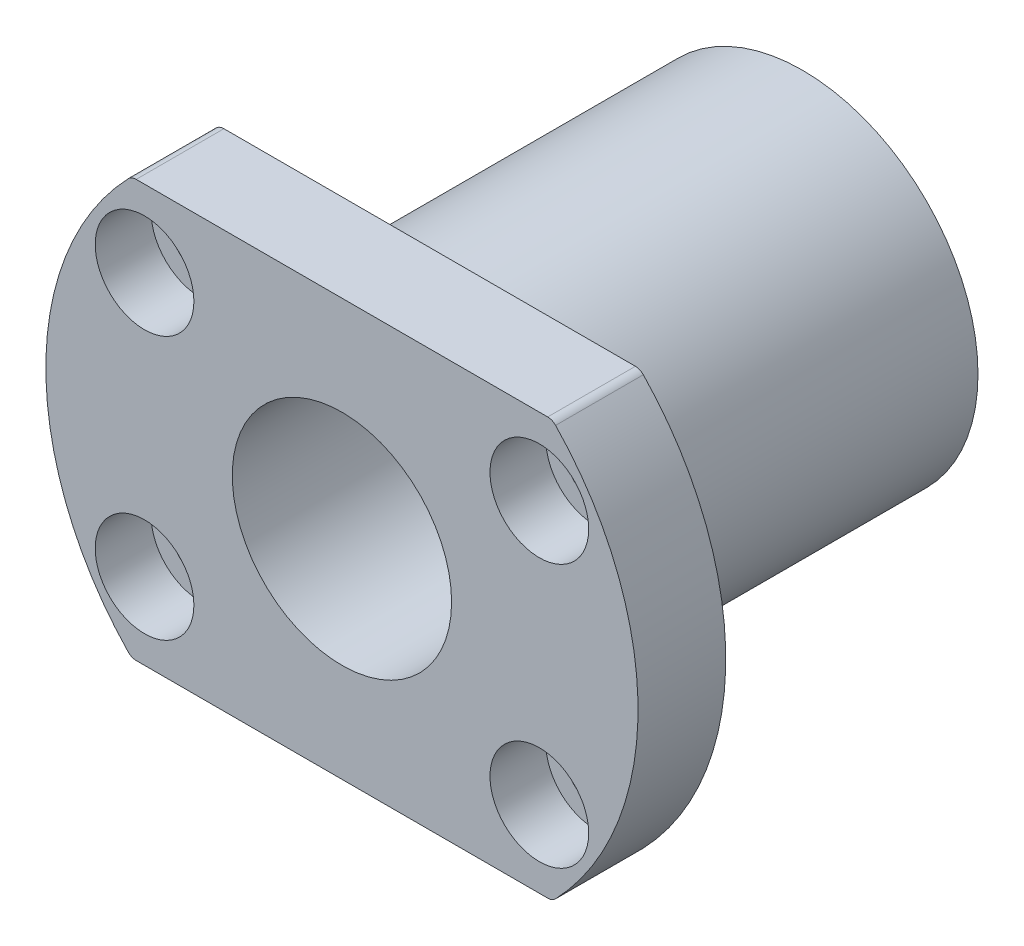
ISO-10303-21;
HEADER;
FILE_DESCRIPTION(('STEP AP214'),'2;1');
FILE_NAME('part.step','',(''),(''),'','','');
FILE_SCHEMA(('AUTOMOTIVE_DESIGN { 1 0 10303 214 1 1 1 1 }'));
ENDSEC;
DATA;
#1=APPLICATION_CONTEXT('core data for automotive mechanical design processes');
#2=APPLICATION_PROTOCOL_DEFINITION('international standard','automotive_design',2000,#1);
#3=PRODUCT_CONTEXT('',#1,'mechanical');
#4=PRODUCT('Part','Part','',(#3));
#5=PRODUCT_RELATED_PRODUCT_CATEGORY('part','',(#4));
#6=PRODUCT_DEFINITION_FORMATION('','',#4);
#7=PRODUCT_DEFINITION_CONTEXT('part definition',#1,'design');
#8=PRODUCT_DEFINITION('design','',#6,#7);
#9=PRODUCT_DEFINITION_SHAPE('','',#8);
#10=(LENGTH_UNIT() NAMED_UNIT(*) SI_UNIT(.MILLI.,.METRE.));
#11=(NAMED_UNIT(*) PLANE_ANGLE_UNIT() SI_UNIT($,.RADIAN.));
#12=(NAMED_UNIT(*) SI_UNIT($,.STERADIAN.) SOLID_ANGLE_UNIT());
#13=UNCERTAINTY_MEASURE_WITH_UNIT(LENGTH_MEASURE(1.E-05),#10,'distance_accuracy_value','');
#14=(GEOMETRIC_REPRESENTATION_CONTEXT(3) GLOBAL_UNCERTAINTY_ASSIGNED_CONTEXT((#13)) GLOBAL_UNIT_ASSIGNED_CONTEXT((#10,
#11,#12)) REPRESENTATION_CONTEXT('',''));
#15=CARTESIAN_POINT('',(0.,0.,0.));
#16=DIRECTION('',(0.,0.,1.));
#17=DIRECTION('',(1.,0.,0.));
#18=AXIS2_PLACEMENT_3D('',#15,#16,#17);
#19=CARTESIAN_POINT('',(0.,0.,0.));
#20=DIRECTION('',(0.,0.,1.));
#21=DIRECTION('',(1.,0.,0.));
#22=AXIS2_PLACEMENT_3D('',#19,#20,#21);
#23=PLANE('',#22);
#24=CARTESIAN_POINT('',(0.,0.,0.));
#25=DIRECTION('',(0.,0.,1.));
#26=DIRECTION('',(1.,0.,0.));
#27=AXIS2_PLACEMENT_3D('',#24,#25,#26);
#28=CIRCLE('',#27,16.);
#29=CARTESIAN_POINT('',(16.,0.,0.));
#30=VERTEX_POINT('',#29);
#31=EDGE_CURVE('E140',#30,#30,#28,.T.);
#32=ORIENTED_EDGE('',*,*,#31,.F.);
#33=EDGE_LOOP('',(#32));
#34=FACE_BOUND('',#33,.T.);
#35=CARTESIAN_POINT('',(0.,0.,0.));
#36=DIRECTION('',(0.,0.,1.));
#37=DIRECTION('',(1.,0.,0.));
#38=AXIS2_PLACEMENT_3D('',#35,#36,#37);
#39=CIRCLE('',#38,10.);
#40=CARTESIAN_POINT('',(10.,0.,0.));
#41=VERTEX_POINT('',#40);
#42=EDGE_CURVE('E137',#41,#41,#39,.T.);
#43=ORIENTED_EDGE('',*,*,#42,.T.);
#44=EDGE_LOOP('',(#43));
#45=FACE_BOUND('',#44,.T.);
#46=ADVANCED_FACE('F36',(#34,#45),#23,.F.);
#47=CARTESIAN_POINT('',(0.,0.,34.));
#48=DIRECTION('',(0.,0.,-1.));
#49=DIRECTION('',(-1.,0.,0.));
#50=AXIS2_PLACEMENT_3D('',#47,#48,#49);
#51=CYLINDRICAL_SURFACE('',#50,16.);
#52=CARTESIAN_POINT('',(0.,0.,34.));
#53=DIRECTION('',(0.,0.,1.));
#54=DIRECTION('',(1.,0.,0.));
#55=AXIS2_PLACEMENT_3D('',#52,#53,#54);
#56=CIRCLE('',#55,16.);
#57=CARTESIAN_POINT('',(16.,0.,34.));
#58=VERTEX_POINT('',#57);
#59=EDGE_CURVE('E141',#58,#58,#56,.T.);
#60=ORIENTED_EDGE('',*,*,#59,.F.);
#61=EDGE_LOOP('',(#60));
#62=FACE_BOUND('',#61,.T.);
#63=ORIENTED_EDGE('',*,*,#31,.T.);
#64=EDGE_LOOP('',(#63));
#65=FACE_BOUND('',#64,.T.);
#66=ADVANCED_FACE('F251',(#62,#65),#51,.T.);
#67=CARTESIAN_POINT('',(0.,0.,34.));
#68=DIRECTION('',(0.,0.,-1.));
#69=DIRECTION('',(-1.,0.,0.));
#70=AXIS2_PLACEMENT_3D('',#67,#68,#69);
#71=CYLINDRICAL_SURFACE('',#70,10.);
#72=ORIENTED_EDGE('',*,*,#42,.F.);
#73=EDGE_LOOP('',(#72));
#74=FACE_BOUND('',#73,.T.);
#75=CARTESIAN_POINT('',(0.,0.,42.));
#76=DIRECTION('',(0.,0.,1.));
#77=DIRECTION('',(1.,0.,0.));
#78=AXIS2_PLACEMENT_3D('',#75,#76,#77);
#79=CIRCLE('',#78,10.);
#80=CARTESIAN_POINT('',(10.,0.,42.));
#81=VERTEX_POINT('',#80);
#82=EDGE_CURVE('E149',#81,#81,#79,.T.);
#83=ORIENTED_EDGE('',*,*,#82,.T.);
#84=EDGE_LOOP('',(#83));
#85=FACE_BOUND('',#84,.T.);
#86=ADVANCED_FACE('F239',(#74,#85),#71,.F.);
#87=CARTESIAN_POINT('',(0.,0.,42.));
#88=DIRECTION('',(0.,0.,1.));
#89=DIRECTION('',(1.,0.,0.));
#90=AXIS2_PLACEMENT_3D('',#87,#88,#89);
#91=PLANE('',#90);
#92=CARTESIAN_POINT('',(-18.,-12.,42.));
#93=DIRECTION('',(0.,0.,1.));
#94=DIRECTION('',(1.,0.,0.));
#95=AXIS2_PLACEMENT_3D('',#92,#93,#94);
#96=CIRCLE('',#95,4.49999999999999);
#97=CARTESIAN_POINT('',(-13.5,-12.,42.));
#98=VERTEX_POINT('',#97);
#99=EDGE_CURVE('E230',#98,#98,#96,.T.);
#100=ORIENTED_EDGE('',*,*,#99,.F.);
#101=EDGE_LOOP('',(#100));
#102=FACE_BOUND('',#101,.T.);
#103=CARTESIAN_POINT('',(-18.,12.,42.));
#104=DIRECTION('',(0.,0.,1.));
#105=DIRECTION('',(1.,0.,0.));
#106=AXIS2_PLACEMENT_3D('',#103,#104,#105);
#107=CIRCLE('',#106,4.49999999999999);
#108=CARTESIAN_POINT('',(-13.5,12.,42.));
#109=VERTEX_POINT('',#108);
#110=EDGE_CURVE('E164',#109,#109,#107,.T.);
#111=ORIENTED_EDGE('',*,*,#110,.F.);
#112=EDGE_LOOP('',(#111));
#113=FACE_BOUND('',#112,.T.);
#114=CARTESIAN_POINT('',(18.,12.,42.));
#115=DIRECTION('',(0.,0.,1.));
#116=DIRECTION('',(1.,0.,0.));
#117=AXIS2_PLACEMENT_3D('',#114,#115,#116);
#118=CIRCLE('',#117,4.49999999999999);
#119=CARTESIAN_POINT('',(22.5,12.,42.));
#120=VERTEX_POINT('',#119);
#121=EDGE_CURVE('E159',#120,#120,#118,.T.);
#122=ORIENTED_EDGE('',*,*,#121,.F.);
#123=EDGE_LOOP('',(#122));
#124=FACE_BOUND('',#123,.T.);
#125=CARTESIAN_POINT('',(18.,-12.,42.));
#126=DIRECTION('',(0.,0.,1.));
#127=DIRECTION('',(1.,0.,0.));
#128=AXIS2_PLACEMENT_3D('',#125,#126,#127);
#129=CIRCLE('',#128,4.49999999999999);
#130=CARTESIAN_POINT('',(22.5,-12.,42.));
#131=VERTEX_POINT('',#130);
#132=EDGE_CURVE('E154',#131,#131,#129,.T.);
#133=ORIENTED_EDGE('',*,*,#132,.F.);
#134=EDGE_LOOP('',(#133));
#135=FACE_BOUND('',#134,.T.);
#136=CARTESIAN_POINT('',(0.,0.,42.));
#137=DIRECTION('',(0.,0.,1.));
#138=DIRECTION('',(1.,0.,0.));
#139=AXIS2_PLACEMENT_3D('',#136,#137,#138);
#140=CIRCLE('',#139,27.);
#141=CARTESIAN_POINT('',(19.4832654638819,-18.6923076923077,42.));
#142=VERTEX_POINT('',#141);
#143=CARTESIAN_POINT('',(19.4832654638819,18.6923076923077,42.));
#144=VERTEX_POINT('',#143);
#145=EDGE_CURVE('E200',#142,#144,#140,.T.);
#146=ORIENTED_EDGE('',*,*,#145,.T.);
#147=CARTESIAN_POINT('',(18.7616630392937,18.,42.));
#148=DIRECTION('',(0.,0.,1.));
#149=DIRECTION('',(1.,0.,0.));
#150=AXIS2_PLACEMENT_3D('',#147,#148,#149);
#151=CIRCLE('',#150,1.);
#152=CARTESIAN_POINT('',(18.7616630392937,19.,42.));
#153=VERTEX_POINT('',#152);
#154=EDGE_CURVE('E179',#144,#153,#151,.T.);
#155=ORIENTED_EDGE('',*,*,#154,.T.);
#156=DIRECTION('',(-1.,0.,0.));
#157=VECTOR('',#156,1.);
#158=CARTESIAN_POINT('',(-19.1833260932509,19.,42.));
#159=LINE('',#158,#157);
#160=CARTESIAN_POINT('',(-18.7616630392937,19.,42.));
#161=VERTEX_POINT('',#160);
#162=EDGE_CURVE('E122',#153,#161,#159,.T.);
#163=ORIENTED_EDGE('',*,*,#162,.T.);
#164=CARTESIAN_POINT('',(-18.7616630392937,18.,42.));
#165=DIRECTION('',(0.,0.,1.));
#166=DIRECTION('',(1.,0.,0.));
#167=AXIS2_PLACEMENT_3D('',#164,#165,#166);
#168=CIRCLE('',#167,1.);
#169=CARTESIAN_POINT('',(-19.4832654638819,18.6923076923077,42.));
#170=VERTEX_POINT('',#169);
#171=EDGE_CURVE('E177',#161,#170,#168,.T.);
#172=ORIENTED_EDGE('',*,*,#171,.T.);
#173=CARTESIAN_POINT('',(0.,0.,42.));
#174=DIRECTION('',(0.,0.,1.));
#175=DIRECTION('',(1.,0.,0.));
#176=AXIS2_PLACEMENT_3D('',#173,#174,#175);
#177=CIRCLE('',#176,27.);
#178=CARTESIAN_POINT('',(-19.4832654638819,-18.6923076923077,42.));
#179=VERTEX_POINT('',#178);
#180=EDGE_CURVE('E128',#170,#179,#177,.T.);
#181=ORIENTED_EDGE('',*,*,#180,.T.);
#182=CARTESIAN_POINT('',(-18.7616630392937,-18.,42.));
#183=DIRECTION('',(0.,0.,1.));
#184=DIRECTION('',(1.,0.,0.));
#185=AXIS2_PLACEMENT_3D('',#182,#183,#184);
#186=CIRCLE('',#185,1.);
#187=CARTESIAN_POINT('',(-18.7616630392937,-19.,42.));
#188=VERTEX_POINT('',#187);
#189=EDGE_CURVE('E57',#179,#188,#186,.T.);
#190=ORIENTED_EDGE('',*,*,#189,.T.);
#191=DIRECTION('',(1.,0.,0.));
#192=VECTOR('',#191,1.);
#193=CARTESIAN_POINT('',(-19.1833260932509,-19.,42.));
#194=LINE('',#193,#192);
#195=CARTESIAN_POINT('',(18.7616630392937,-19.,42.));
#196=VERTEX_POINT('',#195);
#197=EDGE_CURVE('E131',#188,#196,#194,.T.);
#198=ORIENTED_EDGE('',*,*,#197,.T.);
#199=CARTESIAN_POINT('',(18.7616630392937,-18.,42.));
#200=DIRECTION('',(0.,0.,1.));
#201=DIRECTION('',(1.,0.,0.));
#202=AXIS2_PLACEMENT_3D('',#199,#200,#201);
#203=CIRCLE('',#202,1.);
#204=EDGE_CURVE('E174',#196,#142,#203,.T.);
#205=ORIENTED_EDGE('',*,*,#204,.T.);
#206=EDGE_LOOP('',(#146,#155,#163,#172,#181,#190,#198,#205));
#207=FACE_BOUND('',#206,.T.);
#208=ORIENTED_EDGE('',*,*,#82,.F.);
#209=EDGE_LOOP('',(#208));
#210=FACE_BOUND('',#209,.T.);
#211=ADVANCED_FACE('F236',(#102,#113,#124,#135,#207,#210),#91,.T.);
#212=CARTESIAN_POINT('',(0.,0.,34.));
#213=DIRECTION('',(0.,0.,1.));
#214=DIRECTION('',(1.,0.,0.));
#215=AXIS2_PLACEMENT_3D('',#212,#213,#214);
#216=PLANE('',#215);
#217=CARTESIAN_POINT('',(-18.,-12.,34.));
#218=DIRECTION('',(0.,0.,1.));
#219=DIRECTION('',(1.,0.,0.));
#220=AXIS2_PLACEMENT_3D('',#217,#218,#219);
#221=CIRCLE('',#220,2.75);
#222=CARTESIAN_POINT('',(-15.25,-12.,34.));
#223=VERTEX_POINT('',#222);
#224=EDGE_CURVE('E161',#223,#223,#221,.T.);
#225=ORIENTED_EDGE('',*,*,#224,.T.);
#226=EDGE_LOOP('',(#225));
#227=FACE_BOUND('',#226,.T.);
#228=CARTESIAN_POINT('',(-18.,12.,34.));
#229=DIRECTION('',(0.,0.,1.));
#230=DIRECTION('',(1.,0.,0.));
#231=AXIS2_PLACEMENT_3D('',#228,#229,#230);
#232=CIRCLE('',#231,2.75);
#233=CARTESIAN_POINT('',(-15.25,12.,34.));
#234=VERTEX_POINT('',#233);
#235=EDGE_CURVE('E156',#234,#234,#232,.T.);
#236=ORIENTED_EDGE('',*,*,#235,.T.);
#237=EDGE_LOOP('',(#236));
#238=FACE_BOUND('',#237,.T.);
#239=CARTESIAN_POINT('',(18.,12.,34.));
#240=DIRECTION('',(0.,0.,1.));
#241=DIRECTION('',(1.,0.,0.));
#242=AXIS2_PLACEMENT_3D('',#239,#240,#241);
#243=CIRCLE('',#242,2.75);
#244=CARTESIAN_POINT('',(20.75,12.,34.));
#245=VERTEX_POINT('',#244);
#246=EDGE_CURVE('E151',#245,#245,#243,.T.);
#247=ORIENTED_EDGE('',*,*,#246,.T.);
#248=EDGE_LOOP('',(#247));
#249=FACE_BOUND('',#248,.T.);
#250=CARTESIAN_POINT('',(18.,-12.,34.));
#251=DIRECTION('',(0.,0.,1.));
#252=DIRECTION('',(1.,0.,0.));
#253=AXIS2_PLACEMENT_3D('',#250,#251,#252);
#254=CIRCLE('',#253,2.75);
#255=CARTESIAN_POINT('',(20.75,-12.,34.));
#256=VERTEX_POINT('',#255);
#257=EDGE_CURVE('E146',#256,#256,#254,.T.);
#258=ORIENTED_EDGE('',*,*,#257,.T.);
#259=EDGE_LOOP('',(#258));
#260=FACE_BOUND('',#259,.T.);
#261=ORIENTED_EDGE('',*,*,#59,.T.);
#262=EDGE_LOOP('',(#261));
#263=FACE_BOUND('',#262,.T.);
#264=DIRECTION('',(-1.,0.,0.));
#265=VECTOR('',#264,1.);
#266=CARTESIAN_POINT('',(-19.1833260932509,19.,34.));
#267=LINE('',#266,#265);
#268=CARTESIAN_POINT('',(18.7616630392937,19.,34.));
#269=VERTEX_POINT('',#268);
#270=CARTESIAN_POINT('',(-18.7616630392937,19.,34.));
#271=VERTEX_POINT('',#270);
#272=EDGE_CURVE('E119',#269,#271,#267,.T.);
#273=ORIENTED_EDGE('',*,*,#272,.F.);
#274=CARTESIAN_POINT('',(18.7616630392937,18.,34.));
#275=DIRECTION('',(0.,0.,1.));
#276=DIRECTION('',(1.,0.,0.));
#277=AXIS2_PLACEMENT_3D('',#274,#275,#276);
#278=CIRCLE('',#277,1.);
#279=CARTESIAN_POINT('',(19.4832654638819,18.6923076923077,34.));
#280=VERTEX_POINT('',#279);
#281=EDGE_CURVE('E102',#269,#280,#278,.F.);
#282=ORIENTED_EDGE('',*,*,#281,.T.);
#283=CARTESIAN_POINT('',(0.,0.,34.));
#284=DIRECTION('',(0.,0.,1.));
#285=DIRECTION('',(1.,0.,0.));
#286=AXIS2_PLACEMENT_3D('',#283,#284,#285);
#287=CIRCLE('',#286,27.);
#288=CARTESIAN_POINT('',(19.4832654638819,-18.6923076923077,34.));
#289=VERTEX_POINT('',#288);
#290=EDGE_CURVE('E129',#289,#280,#287,.T.);
#291=ORIENTED_EDGE('',*,*,#290,.F.);
#292=CARTESIAN_POINT('',(18.7616630392937,-18.,34.));
#293=DIRECTION('',(0.,0.,1.));
#294=DIRECTION('',(1.,0.,0.));
#295=AXIS2_PLACEMENT_3D('',#292,#293,#294);
#296=CIRCLE('',#295,1.);
#297=CARTESIAN_POINT('',(18.7616630392937,-19.,34.));
#298=VERTEX_POINT('',#297);
#299=EDGE_CURVE('E123',#289,#298,#296,.F.);
#300=ORIENTED_EDGE('',*,*,#299,.T.);
#301=DIRECTION('',(1.,0.,0.));
#302=VECTOR('',#301,1.);
#303=CARTESIAN_POINT('',(-19.1833260932509,-19.,34.));
#304=LINE('',#303,#302);
#305=CARTESIAN_POINT('',(-18.7616630392937,-19.,34.));
#306=VERTEX_POINT('',#305);
#307=EDGE_CURVE('E133',#306,#298,#304,.T.);
#308=ORIENTED_EDGE('',*,*,#307,.F.);
#309=CARTESIAN_POINT('',(-18.7616630392937,-18.,34.));
#310=DIRECTION('',(0.,0.,1.));
#311=DIRECTION('',(1.,0.,0.));
#312=AXIS2_PLACEMENT_3D('',#309,#310,#311);
#313=CIRCLE('',#312,1.);
#314=CARTESIAN_POINT('',(-19.4832654638819,-18.6923076923077,34.));
#315=VERTEX_POINT('',#314);
#316=EDGE_CURVE('E168',#306,#315,#313,.F.);
#317=ORIENTED_EDGE('',*,*,#316,.T.);
#318=CARTESIAN_POINT('',(0.,0.,34.));
#319=DIRECTION('',(0.,0.,1.));
#320=DIRECTION('',(1.,0.,0.));
#321=AXIS2_PLACEMENT_3D('',#318,#319,#320);
#322=CIRCLE('',#321,27.);
#323=CARTESIAN_POINT('',(-19.4832654638819,18.6923076923077,34.));
#324=VERTEX_POINT('',#323);
#325=EDGE_CURVE('E190',#324,#315,#322,.T.);
#326=ORIENTED_EDGE('',*,*,#325,.F.);
#327=CARTESIAN_POINT('',(-18.7616630392937,18.,34.));
#328=DIRECTION('',(0.,0.,1.));
#329=DIRECTION('',(1.,0.,0.));
#330=AXIS2_PLACEMENT_3D('',#327,#328,#329);
#331=CIRCLE('',#330,1.);
#332=EDGE_CURVE('E113',#324,#271,#331,.F.);
#333=ORIENTED_EDGE('',*,*,#332,.T.);
#334=EDGE_LOOP('',(#273,#282,#291,#300,#308,#317,#326,#333));
#335=FACE_BOUND('',#334,.T.);
#336=ADVANCED_FACE('F126',(#227,#238,#249,#260,#263,#335),#216,.F.);
#337=CARTESIAN_POINT('',(0.,0.,42.));
#338=DIRECTION('',(0.,0.,-1.));
#339=DIRECTION('',(-1.,0.,0.));
#340=AXIS2_PLACEMENT_3D('',#337,#338,#339);
#341=CYLINDRICAL_SURFACE('',#340,27.);
#342=ORIENTED_EDGE('',*,*,#180,.F.);
#343=DIRECTION('',(0.,0.,-1.));
#344=VECTOR('',#343,1.);
#345=CARTESIAN_POINT('',(-19.4832654638819,18.6923076923077,42.));
#346=LINE('',#345,#344);
#347=EDGE_CURVE('E183',#170,#324,#346,.T.);
#348=ORIENTED_EDGE('',*,*,#347,.T.);
#349=ORIENTED_EDGE('',*,*,#325,.T.);
#350=DIRECTION('',(0.,0.,-1.));
#351=VECTOR('',#350,1.);
#352=CARTESIAN_POINT('',(-19.4832654638819,-18.6923076923077,42.));
#353=LINE('',#352,#351);
#354=EDGE_CURVE('E181',#315,#179,#353,.F.);
#355=ORIENTED_EDGE('',*,*,#354,.T.);
#356=EDGE_LOOP('',(#342,#348,#349,#355));
#357=FACE_BOUND('',#356,.T.);
#358=ADVANCED_FACE('F189',(#357),#341,.T.);
#359=CARTESIAN_POINT('',(-19.1833260932509,-19.,42.));
#360=DIRECTION('',(0.,1.,0.));
#361=DIRECTION('',(0.,0.,1.));
#362=AXIS2_PLACEMENT_3D('',#359,#360,#361);
#363=PLANE('',#362);
#364=ORIENTED_EDGE('',*,*,#197,.F.);
#365=DIRECTION('',(0.,0.,-1.));
#366=VECTOR('',#365,1.);
#367=CARTESIAN_POINT('',(-18.7616630392937,-19.,42.));
#368=LINE('',#367,#366);
#369=EDGE_CURVE('E11',#188,#306,#368,.T.);
#370=ORIENTED_EDGE('',*,*,#369,.T.);
#371=ORIENTED_EDGE('',*,*,#307,.T.);
#372=DIRECTION('',(0.,0.,-1.));
#373=VECTOR('',#372,1.);
#374=CARTESIAN_POINT('',(18.7616630392937,-19.,42.));
#375=LINE('',#374,#373);
#376=EDGE_CURVE('E44',#298,#196,#375,.F.);
#377=ORIENTED_EDGE('',*,*,#376,.T.);
#378=EDGE_LOOP('',(#364,#370,#371,#377));
#379=FACE_BOUND('',#378,.T.);
#380=ADVANCED_FACE('F281',(#379),#363,.F.);
#381=CARTESIAN_POINT('',(0.,0.,42.));
#382=DIRECTION('',(0.,0.,-1.));
#383=DIRECTION('',(-1.,0.,0.));
#384=AXIS2_PLACEMENT_3D('',#381,#382,#383);
#385=CYLINDRICAL_SURFACE('',#384,27.);
#386=ORIENTED_EDGE('',*,*,#290,.T.);
#387=DIRECTION('',(0.,0.,-1.));
#388=VECTOR('',#387,1.);
#389=CARTESIAN_POINT('',(19.4832654638819,18.6923076923077,42.));
#390=LINE('',#389,#388);
#391=EDGE_CURVE('E107',#280,#144,#390,.F.);
#392=ORIENTED_EDGE('',*,*,#391,.T.);
#393=ORIENTED_EDGE('',*,*,#145,.F.);
#394=DIRECTION('',(0.,0.,-1.));
#395=VECTOR('',#394,1.);
#396=CARTESIAN_POINT('',(19.4832654638819,-18.6923076923077,42.));
#397=LINE('',#396,#395);
#398=EDGE_CURVE('E112',#142,#289,#397,.T.);
#399=ORIENTED_EDGE('',*,*,#398,.T.);
#400=EDGE_LOOP('',(#386,#392,#393,#399));
#401=FACE_BOUND('',#400,.T.);
#402=ADVANCED_FACE('F285',(#401),#385,.T.);
#403=CARTESIAN_POINT('',(-19.1833260932509,19.,42.));
#404=DIRECTION('',(0.,-1.,0.));
#405=DIRECTION('',(0.,0.,-1.));
#406=AXIS2_PLACEMENT_3D('',#403,#404,#405);
#407=PLANE('',#406);
#408=ORIENTED_EDGE('',*,*,#162,.F.);
#409=DIRECTION('',(0.,0.,-1.));
#410=VECTOR('',#409,1.);
#411=CARTESIAN_POINT('',(18.7616630392937,19.,42.));
#412=LINE('',#411,#410);
#413=EDGE_CURVE('E106',#153,#269,#412,.T.);
#414=ORIENTED_EDGE('',*,*,#413,.T.);
#415=ORIENTED_EDGE('',*,*,#272,.T.);
#416=DIRECTION('',(0.,0.,-1.));
#417=VECTOR('',#416,1.);
#418=CARTESIAN_POINT('',(-18.7616630392937,19.,42.));
#419=LINE('',#418,#417);
#420=EDGE_CURVE('E124',#271,#161,#419,.F.);
#421=ORIENTED_EDGE('',*,*,#420,.T.);
#422=EDGE_LOOP('',(#408,#414,#415,#421));
#423=FACE_BOUND('',#422,.T.);
#424=ADVANCED_FACE('F118',(#423),#407,.F.);
#425=CARTESIAN_POINT('',(18.,-12.,42.));
#426=DIRECTION('',(0.,0.,1.));
#427=DIRECTION('',(1.,0.,0.));
#428=AXIS2_PLACEMENT_3D('',#425,#426,#427);
#429=CYLINDRICAL_SURFACE('',#428,2.75);
#430=CARTESIAN_POINT('',(18.,-12.,36.9));
#431=DIRECTION('',(0.,0.,1.));
#432=DIRECTION('',(1.,0.,0.));
#433=AXIS2_PLACEMENT_3D('',#430,#431,#432);
#434=CIRCLE('',#433,2.75);
#435=CARTESIAN_POINT('',(20.75,-12.,36.9));
#436=VERTEX_POINT('',#435);
#437=EDGE_CURVE('E150',#436,#436,#434,.T.);
#438=ORIENTED_EDGE('',*,*,#437,.T.);
#439=EDGE_LOOP('',(#438));
#440=FACE_BOUND('',#439,.T.);
#441=ORIENTED_EDGE('',*,*,#257,.F.);
#442=EDGE_LOOP('',(#441));
#443=FACE_BOUND('',#442,.T.);
#444=ADVANCED_FACE('F292',(#440,#443),#429,.F.);
#445=CARTESIAN_POINT('',(20.75,-12.,36.9));
#446=DIRECTION('',(0.,0.,-1.));
#447=DIRECTION('',(-1.,0.,0.));
#448=AXIS2_PLACEMENT_3D('',#445,#446,#447);
#449=PLANE('',#448);
#450=ORIENTED_EDGE('',*,*,#437,.F.);
#451=EDGE_LOOP('',(#450));
#452=FACE_BOUND('',#451,.T.);
#453=CARTESIAN_POINT('',(18.,-12.,36.9));
#454=DIRECTION('',(0.,0.,1.));
#455=DIRECTION('',(1.,0.,0.));
#456=AXIS2_PLACEMENT_3D('',#453,#454,#455);
#457=CIRCLE('',#456,4.5);
#458=CARTESIAN_POINT('',(22.5,-12.,36.9));
#459=VERTEX_POINT('',#458);
#460=EDGE_CURVE('E206',#459,#459,#457,.T.);
#461=ORIENTED_EDGE('',*,*,#460,.T.);
#462=EDGE_LOOP('',(#461));
#463=FACE_BOUND('',#462,.T.);
#464=ADVANCED_FACE('F307',(#452,#463),#449,.F.);
#465=CARTESIAN_POINT('',(18.,-12.,42.));
#466=DIRECTION('',(0.,0.,1.));
#467=DIRECTION('',(1.,0.,0.));
#468=AXIS2_PLACEMENT_3D('',#465,#466,#467);
#469=CYLINDRICAL_SURFACE('',#468,4.5);
#470=ORIENTED_EDGE('',*,*,#460,.F.);
#471=EDGE_LOOP('',(#470));
#472=FACE_BOUND('',#471,.T.);
#473=ORIENTED_EDGE('',*,*,#132,.T.);
#474=EDGE_LOOP('',(#473));
#475=FACE_BOUND('',#474,.T.);
#476=ADVANCED_FACE('F311',(#472,#475),#469,.F.);
#477=CARTESIAN_POINT('',(18.,12.,42.));
#478=DIRECTION('',(0.,0.,1.));
#479=DIRECTION('',(1.,0.,0.));
#480=AXIS2_PLACEMENT_3D('',#477,#478,#479);
#481=CYLINDRICAL_SURFACE('',#480,2.75);
#482=CARTESIAN_POINT('',(18.,12.,36.9));
#483=DIRECTION('',(0.,0.,1.));
#484=DIRECTION('',(1.,0.,0.));
#485=AXIS2_PLACEMENT_3D('',#482,#483,#484);
#486=CIRCLE('',#485,2.75);
#487=CARTESIAN_POINT('',(20.75,12.,36.9));
#488=VERTEX_POINT('',#487);
#489=EDGE_CURVE('E155',#488,#488,#486,.T.);
#490=ORIENTED_EDGE('',*,*,#489,.T.);
#491=EDGE_LOOP('',(#490));
#492=FACE_BOUND('',#491,.T.);
#493=ORIENTED_EDGE('',*,*,#246,.F.);
#494=EDGE_LOOP('',(#493));
#495=FACE_BOUND('',#494,.T.);
#496=ADVANCED_FACE('F315',(#492,#495),#481,.F.);
#497=CARTESIAN_POINT('',(20.75,12.,36.9));
#498=DIRECTION('',(0.,0.,-1.));
#499=DIRECTION('',(-1.,0.,0.));
#500=AXIS2_PLACEMENT_3D('',#497,#498,#499);
#501=PLANE('',#500);
#502=ORIENTED_EDGE('',*,*,#489,.F.);
#503=EDGE_LOOP('',(#502));
#504=FACE_BOUND('',#503,.T.);
#505=CARTESIAN_POINT('',(18.,12.,36.9));
#506=DIRECTION('',(0.,0.,1.));
#507=DIRECTION('',(1.,0.,0.));
#508=AXIS2_PLACEMENT_3D('',#505,#506,#507);
#509=CIRCLE('',#508,4.5);
#510=CARTESIAN_POINT('',(22.5,12.,36.9));
#511=VERTEX_POINT('',#510);
#512=EDGE_CURVE('E213',#511,#511,#509,.T.);
#513=ORIENTED_EDGE('',*,*,#512,.T.);
#514=EDGE_LOOP('',(#513));
#515=FACE_BOUND('',#514,.T.);
#516=ADVANCED_FACE('F319',(#504,#515),#501,.F.);
#517=CARTESIAN_POINT('',(18.,12.,42.));
#518=DIRECTION('',(0.,0.,1.));
#519=DIRECTION('',(1.,0.,0.));
#520=AXIS2_PLACEMENT_3D('',#517,#518,#519);
#521=CYLINDRICAL_SURFACE('',#520,4.5);
#522=ORIENTED_EDGE('',*,*,#512,.F.);
#523=EDGE_LOOP('',(#522));
#524=FACE_BOUND('',#523,.T.);
#525=ORIENTED_EDGE('',*,*,#121,.T.);
#526=EDGE_LOOP('',(#525));
#527=FACE_BOUND('',#526,.T.);
#528=ADVANCED_FACE('F323',(#524,#527),#521,.F.);
#529=CARTESIAN_POINT('',(-18.,12.,42.));
#530=DIRECTION('',(0.,0.,1.));
#531=DIRECTION('',(1.,0.,0.));
#532=AXIS2_PLACEMENT_3D('',#529,#530,#531);
#533=CYLINDRICAL_SURFACE('',#532,2.75);
#534=CARTESIAN_POINT('',(-18.,12.,36.9));
#535=DIRECTION('',(0.,0.,1.));
#536=DIRECTION('',(1.,0.,0.));
#537=AXIS2_PLACEMENT_3D('',#534,#535,#536);
#538=CIRCLE('',#537,2.75);
#539=CARTESIAN_POINT('',(-15.25,12.,36.9));
#540=VERTEX_POINT('',#539);
#541=EDGE_CURVE('E160',#540,#540,#538,.T.);
#542=ORIENTED_EDGE('',*,*,#541,.T.);
#543=EDGE_LOOP('',(#542));
#544=FACE_BOUND('',#543,.T.);
#545=ORIENTED_EDGE('',*,*,#235,.F.);
#546=EDGE_LOOP('',(#545));
#547=FACE_BOUND('',#546,.T.);
#548=ADVANCED_FACE('F327',(#544,#547),#533,.F.);
#549=CARTESIAN_POINT('',(-15.25,12.,36.9));
#550=DIRECTION('',(0.,0.,-1.));
#551=DIRECTION('',(-1.,0.,0.));
#552=AXIS2_PLACEMENT_3D('',#549,#550,#551);
#553=PLANE('',#552);
#554=ORIENTED_EDGE('',*,*,#541,.F.);
#555=EDGE_LOOP('',(#554));
#556=FACE_BOUND('',#555,.T.);
#557=CARTESIAN_POINT('',(-18.,12.,36.9));
#558=DIRECTION('',(0.,0.,1.));
#559=DIRECTION('',(1.,0.,0.));
#560=AXIS2_PLACEMENT_3D('',#557,#558,#559);
#561=CIRCLE('',#560,4.5);
#562=CARTESIAN_POINT('',(-13.5,12.,36.9));
#563=VERTEX_POINT('',#562);
#564=EDGE_CURVE('E220',#563,#563,#561,.T.);
#565=ORIENTED_EDGE('',*,*,#564,.T.);
#566=EDGE_LOOP('',(#565));
#567=FACE_BOUND('',#566,.T.);
#568=ADVANCED_FACE('F331',(#556,#567),#553,.F.);
#569=CARTESIAN_POINT('',(-18.,12.,42.));
#570=DIRECTION('',(0.,0.,1.));
#571=DIRECTION('',(1.,0.,0.));
#572=AXIS2_PLACEMENT_3D('',#569,#570,#571);
#573=CYLINDRICAL_SURFACE('',#572,4.5);
#574=ORIENTED_EDGE('',*,*,#564,.F.);
#575=EDGE_LOOP('',(#574));
#576=FACE_BOUND('',#575,.T.);
#577=ORIENTED_EDGE('',*,*,#110,.T.);
#578=EDGE_LOOP('',(#577));
#579=FACE_BOUND('',#578,.T.);
#580=ADVANCED_FACE('F335',(#576,#579),#573,.F.);
#581=CARTESIAN_POINT('',(-18.,-12.,42.));
#582=DIRECTION('',(0.,0.,1.));
#583=DIRECTION('',(1.,0.,0.));
#584=AXIS2_PLACEMENT_3D('',#581,#582,#583);
#585=CYLINDRICAL_SURFACE('',#584,2.75);
#586=CARTESIAN_POINT('',(-18.,-12.,36.9));
#587=DIRECTION('',(0.,0.,1.));
#588=DIRECTION('',(1.,0.,0.));
#589=AXIS2_PLACEMENT_3D('',#586,#587,#588);
#590=CIRCLE('',#589,2.75);
#591=CARTESIAN_POINT('',(-15.25,-12.,36.9));
#592=VERTEX_POINT('',#591);
#593=EDGE_CURVE('E165',#592,#592,#590,.T.);
#594=ORIENTED_EDGE('',*,*,#593,.T.);
#595=EDGE_LOOP('',(#594));
#596=FACE_BOUND('',#595,.T.);
#597=ORIENTED_EDGE('',*,*,#224,.F.);
#598=EDGE_LOOP('',(#597));
#599=FACE_BOUND('',#598,.T.);
#600=ADVANCED_FACE('F339',(#596,#599),#585,.F.);
#601=CARTESIAN_POINT('',(-15.25,-12.,36.9));
#602=DIRECTION('',(0.,0.,-1.));
#603=DIRECTION('',(-1.,0.,0.));
#604=AXIS2_PLACEMENT_3D('',#601,#602,#603);
#605=PLANE('',#604);
#606=ORIENTED_EDGE('',*,*,#593,.F.);
#607=EDGE_LOOP('',(#606));
#608=FACE_BOUND('',#607,.T.);
#609=CARTESIAN_POINT('',(-18.,-12.,36.9));
#610=DIRECTION('',(0.,0.,1.));
#611=DIRECTION('',(1.,0.,0.));
#612=AXIS2_PLACEMENT_3D('',#609,#610,#611);
#613=CIRCLE('',#612,4.5);
#614=CARTESIAN_POINT('',(-13.5,-12.,36.9));
#615=VERTEX_POINT('',#614);
#616=EDGE_CURVE('E227',#615,#615,#613,.T.);
#617=ORIENTED_EDGE('',*,*,#616,.T.);
#618=EDGE_LOOP('',(#617));
#619=FACE_BOUND('',#618,.T.);
#620=ADVANCED_FACE('F343',(#608,#619),#605,.F.);
#621=CARTESIAN_POINT('',(-18.,-12.,42.));
#622=DIRECTION('',(0.,0.,1.));
#623=DIRECTION('',(1.,0.,0.));
#624=AXIS2_PLACEMENT_3D('',#621,#622,#623);
#625=CYLINDRICAL_SURFACE('',#624,4.5);
#626=ORIENTED_EDGE('',*,*,#616,.F.);
#627=EDGE_LOOP('',(#626));
#628=FACE_BOUND('',#627,.T.);
#629=ORIENTED_EDGE('',*,*,#99,.T.);
#630=EDGE_LOOP('',(#629));
#631=FACE_BOUND('',#630,.T.);
#632=ADVANCED_FACE('F234',(#628,#631),#625,.F.);
#633=CARTESIAN_POINT('',(18.7616630392937,18.,42.));
#634=DIRECTION('',(0.,0.,-1.));
#635=DIRECTION('',(-1.,0.,0.));
#636=AXIS2_PLACEMENT_3D('',#633,#634,#635);
#637=CYLINDRICAL_SURFACE('',#636,1.);
#638=ORIENTED_EDGE('',*,*,#154,.F.);
#639=ORIENTED_EDGE('',*,*,#391,.F.);
#640=ORIENTED_EDGE('',*,*,#281,.F.);
#641=ORIENTED_EDGE('',*,*,#413,.F.);
#642=EDGE_LOOP('',(#638,#639,#640,#641));
#643=FACE_BOUND('',#642,.T.);
#644=ADVANCED_FACE('F105',(#643),#637,.T.);
#645=CARTESIAN_POINT('',(-18.7616630392937,18.,42.));
#646=DIRECTION('',(0.,0.,-1.));
#647=DIRECTION('',(-1.,0.,0.));
#648=AXIS2_PLACEMENT_3D('',#645,#646,#647);
#649=CYLINDRICAL_SURFACE('',#648,1.);
#650=ORIENTED_EDGE('',*,*,#171,.F.);
#651=ORIENTED_EDGE('',*,*,#420,.F.);
#652=ORIENTED_EDGE('',*,*,#332,.F.);
#653=ORIENTED_EDGE('',*,*,#347,.F.);
#654=EDGE_LOOP('',(#650,#651,#652,#653));
#655=FACE_BOUND('',#654,.T.);
#656=ADVANCED_FACE('F271',(#655),#649,.T.);
#657=CARTESIAN_POINT('',(-18.7616630392937,-18.,42.));
#658=DIRECTION('',(0.,0.,-1.));
#659=DIRECTION('',(-1.,0.,0.));
#660=AXIS2_PLACEMENT_3D('',#657,#658,#659);
#661=CYLINDRICAL_SURFACE('',#660,1.);
#662=ORIENTED_EDGE('',*,*,#189,.F.);
#663=ORIENTED_EDGE('',*,*,#354,.F.);
#664=ORIENTED_EDGE('',*,*,#316,.F.);
#665=ORIENTED_EDGE('',*,*,#369,.F.);
#666=EDGE_LOOP('',(#662,#663,#664,#665));
#667=FACE_BOUND('',#666,.T.);
#668=ADVANCED_FACE('F273',(#667),#661,.T.);
#669=CARTESIAN_POINT('',(18.7616630392937,-18.,42.));
#670=DIRECTION('',(0.,0.,-1.));
#671=DIRECTION('',(-1.,0.,0.));
#672=AXIS2_PLACEMENT_3D('',#669,#670,#671);
#673=CYLINDRICAL_SURFACE('',#672,1.);
#674=ORIENTED_EDGE('',*,*,#204,.F.);
#675=ORIENTED_EDGE('',*,*,#376,.F.);
#676=ORIENTED_EDGE('',*,*,#299,.F.);
#677=ORIENTED_EDGE('',*,*,#398,.F.);
#678=EDGE_LOOP('',(#674,#675,#676,#677));
#679=FACE_BOUND('',#678,.T.);
#680=ADVANCED_FACE('F38',(#679),#673,.T.);
#681=CLOSED_SHELL('',(#46,#66,#86,#211,#336,#358,#380,#402,#424,#444,#464,#476,#496,#516,#528,
#548,#568,#580,#600,#620,#632,#644,#656,#668,#680));
#682=MANIFOLD_SOLID_BREP('B2',#681);
#683=ADVANCED_BREP_SHAPE_REPRESENTATION('',(#18,#682),#14);
#684=SHAPE_DEFINITION_REPRESENTATION(#9,#683);
ENDSEC;
END-ISO-10303-21;
